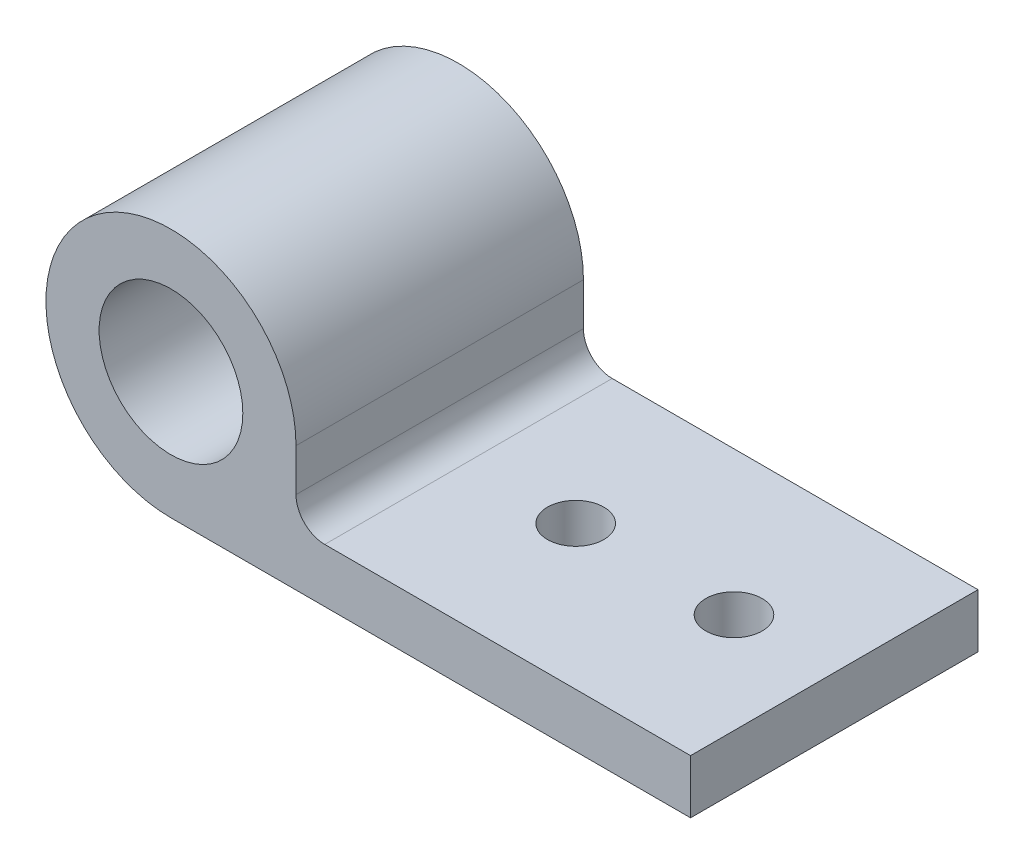
ISO-10303-21;
HEADER;
FILE_DESCRIPTION(('STEP AP214'),'2;1');
FILE_NAME('part.step','',(''),(''),'','','');
FILE_SCHEMA(('AUTOMOTIVE_DESIGN { 1 0 10303 214 1 1 1 1 }'));
ENDSEC;
DATA;
#1=APPLICATION_CONTEXT('core data for automotive mechanical design processes');
#2=APPLICATION_PROTOCOL_DEFINITION('international standard','automotive_design',2000,#1);
#3=PRODUCT_CONTEXT('',#1,'mechanical');
#4=PRODUCT('Part','Part','',(#3));
#5=PRODUCT_RELATED_PRODUCT_CATEGORY('part','',(#4));
#6=PRODUCT_DEFINITION_FORMATION('','',#4);
#7=PRODUCT_DEFINITION_CONTEXT('part definition',#1,'design');
#8=PRODUCT_DEFINITION('design','',#6,#7);
#9=PRODUCT_DEFINITION_SHAPE('','',#8);
#10=(LENGTH_UNIT() NAMED_UNIT(*) SI_UNIT(.MILLI.,.METRE.));
#11=(NAMED_UNIT(*) PLANE_ANGLE_UNIT() SI_UNIT($,.RADIAN.));
#12=(NAMED_UNIT(*) SI_UNIT($,.STERADIAN.) SOLID_ANGLE_UNIT());
#13=UNCERTAINTY_MEASURE_WITH_UNIT(LENGTH_MEASURE(1.E-05),#10,'distance_accuracy_value','');
#14=(GEOMETRIC_REPRESENTATION_CONTEXT(3) GLOBAL_UNCERTAINTY_ASSIGNED_CONTEXT((#13)) GLOBAL_UNIT_ASSIGNED_CONTEXT((#10,
#11,#12)) REPRESENTATION_CONTEXT('',''));
#15=CARTESIAN_POINT('',(0.,0.,0.));
#16=DIRECTION('',(0.,0.,1.));
#17=DIRECTION('',(1.,0.,0.));
#18=AXIS2_PLACEMENT_3D('',#15,#16,#17);
#19=CARTESIAN_POINT('',(13.589,-3.7465,25.4));
#20=DIRECTION('',(0.,0.,-1.));
#21=DIRECTION('',(-1.,0.,0.));
#22=AXIS2_PLACEMENT_3D('',#19,#20,#21);
#23=CYLINDRICAL_SURFACE('',#22,2.54);
#24=DIRECTION('',(0.,0.,1.));
#25=VECTOR('',#24,1.);
#26=CARTESIAN_POINT('',(13.589,-6.2865,25.4));
#27=LINE('',#26,#25);
#28=CARTESIAN_POINT('',(13.589,-6.2865,0.));
#29=VERTEX_POINT('',#28);
#30=CARTESIAN_POINT('',(13.589,-6.2865,25.4));
#31=VERTEX_POINT('',#30);
#32=EDGE_CURVE('E143',#29,#31,#27,.T.);
#33=ORIENTED_EDGE('',*,*,#32,.F.);
#34=CARTESIAN_POINT('',(13.589,-3.7465,0.));
#35=DIRECTION('',(0.,0.,1.));
#36=DIRECTION('',(1.,0.,0.));
#37=AXIS2_PLACEMENT_3D('',#34,#35,#36);
#38=CIRCLE('',#37,2.54);
#39=CARTESIAN_POINT('',(11.049,-3.7465,0.));
#40=VERTEX_POINT('',#39);
#41=EDGE_CURVE('E90',#29,#40,#38,.F.);
#42=ORIENTED_EDGE('',*,*,#41,.T.);
#43=DIRECTION('',(0.,0.,1.));
#44=VECTOR('',#43,1.);
#45=CARTESIAN_POINT('',(11.049,-3.7465,25.4));
#46=LINE('',#45,#44);
#47=CARTESIAN_POINT('',(11.049,-3.7465,25.4));
#48=VERTEX_POINT('',#47);
#49=EDGE_CURVE('E209',#48,#40,#46,.F.);
#50=ORIENTED_EDGE('',*,*,#49,.F.);
#51=CARTESIAN_POINT('',(13.589,-3.7465,25.4));
#52=DIRECTION('',(0.,0.,1.));
#53=DIRECTION('',(1.,0.,0.));
#54=AXIS2_PLACEMENT_3D('',#51,#52,#53);
#55=CIRCLE('',#54,2.54);
#56=EDGE_CURVE('E12',#48,#31,#55,.T.);
#57=ORIENTED_EDGE('',*,*,#56,.T.);
#58=EDGE_LOOP('',(#33,#42,#50,#57));
#59=FACE_BOUND('',#58,.T.);
#60=ADVANCED_FACE('F82',(#59),#23,.F.);
#61=CARTESIAN_POINT('',(0.,-11.049,25.4));
#62=DIRECTION('',(0.,1.,0.));
#63=DIRECTION('',(0.,0.,1.));
#64=AXIS2_PLACEMENT_3D('',#61,#62,#63);
#65=PLANE('',#64);
#66=CARTESIAN_POINT('',(37.0528588893814,-11.049,12.7));
#67=DIRECTION('',(0.,1.,0.));
#68=DIRECTION('',(-1.,0.,0.));
#69=AXIS2_PLACEMENT_3D('',#66,#67,#68);
#70=CIRCLE('',#69,2.4892);
#71=CARTESIAN_POINT('',(34.5636588893814,-11.049,12.7));
#72=VERTEX_POINT('',#71);
#73=EDGE_CURVE('E202',#72,#72,#70,.T.);
#74=ORIENTED_EDGE('',*,*,#73,.T.);
#75=EDGE_LOOP('',(#74));
#76=FACE_BOUND('',#75,.T.);
#77=CARTESIAN_POINT('',(23.0632449919482,-11.049,12.7));
#78=DIRECTION('',(0.,1.,0.));
#79=DIRECTION('',(-1.,0.,0.));
#80=AXIS2_PLACEMENT_3D('',#77,#78,#79);
#81=CIRCLE('',#80,2.4892);
#82=CARTESIAN_POINT('',(20.5740449919482,-11.049,12.7));
#83=VERTEX_POINT('',#82);
#84=EDGE_CURVE('E272',#83,#83,#81,.T.);
#85=ORIENTED_EDGE('',*,*,#84,.T.);
#86=EDGE_LOOP('',(#85));
#87=FACE_BOUND('',#86,.T.);
#88=DIRECTION('',(1.,0.,0.));
#89=VECTOR('',#88,1.);
#90=CARTESIAN_POINT('',(0.,-11.049,0.));
#91=LINE('',#90,#89);
#92=CARTESIAN_POINT('',(0.,-11.049,0.));
#93=VERTEX_POINT('',#92);
#94=CARTESIAN_POINT('',(45.91627088,-11.049,0.));
#95=VERTEX_POINT('',#94);
#96=EDGE_CURVE('E154',#93,#95,#91,.T.);
#97=ORIENTED_EDGE('',*,*,#96,.T.);
#98=DIRECTION('',(0.,0.,-1.));
#99=VECTOR('',#98,1.);
#100=CARTESIAN_POINT('',(45.91627088,-11.049,25.4));
#101=LINE('',#100,#99);
#102=CARTESIAN_POINT('',(45.91627088,-11.049,25.4));
#103=VERTEX_POINT('',#102);
#104=EDGE_CURVE('E144',#103,#95,#101,.T.);
#105=ORIENTED_EDGE('',*,*,#104,.F.);
#106=DIRECTION('',(1.,0.,0.));
#107=VECTOR('',#106,1.);
#108=CARTESIAN_POINT('',(0.,-11.049,25.4));
#109=LINE('',#108,#107);
#110=CARTESIAN_POINT('',(0.,-11.049,25.4));
#111=VERTEX_POINT('',#110);
#112=EDGE_CURVE('E149',#111,#103,#109,.T.);
#113=ORIENTED_EDGE('',*,*,#112,.F.);
#114=DIRECTION('',(0.,0.,-1.));
#115=VECTOR('',#114,1.);
#116=CARTESIAN_POINT('',(0.,-11.049,25.4));
#117=LINE('',#116,#115);
#118=EDGE_CURVE('E133',#111,#93,#117,.T.);
#119=ORIENTED_EDGE('',*,*,#118,.T.);
#120=EDGE_LOOP('',(#97,#105,#113,#119));
#121=FACE_BOUND('',#120,.T.);
#122=ADVANCED_FACE('F156',(#76,#87,#121),#65,.F.);
#123=CARTESIAN_POINT('',(45.91627088,0.,25.4));
#124=DIRECTION('',(-1.,0.,0.));
#125=DIRECTION('',(0.,0.,1.));
#126=AXIS2_PLACEMENT_3D('',#123,#124,#125);
#127=PLANE('',#126);
#128=DIRECTION('',(0.,1.,0.));
#129=VECTOR('',#128,1.);
#130=CARTESIAN_POINT('',(45.91627088,0.,0.));
#131=LINE('',#130,#129);
#132=CARTESIAN_POINT('',(45.91627088,-6.2865,0.));
#133=VERTEX_POINT('',#132);
#134=EDGE_CURVE('E181',#95,#133,#131,.T.);
#135=ORIENTED_EDGE('',*,*,#134,.T.);
#136=DIRECTION('',(0.,0.,-1.));
#137=VECTOR('',#136,1.);
#138=CARTESIAN_POINT('',(45.91627088,-6.2865,25.4));
#139=LINE('',#138,#137);
#140=CARTESIAN_POINT('',(45.91627088,-6.2865,25.4));
#141=VERTEX_POINT('',#140);
#142=EDGE_CURVE('E189',#141,#133,#139,.T.);
#143=ORIENTED_EDGE('',*,*,#142,.F.);
#144=DIRECTION('',(0.,1.,0.));
#145=VECTOR('',#144,1.);
#146=CARTESIAN_POINT('',(45.91627088,0.,25.4));
#147=LINE('',#146,#145);
#148=EDGE_CURVE('E160',#103,#141,#147,.T.);
#149=ORIENTED_EDGE('',*,*,#148,.F.);
#150=ORIENTED_EDGE('',*,*,#104,.T.);
#151=EDGE_LOOP('',(#135,#143,#149,#150));
#152=FACE_BOUND('',#151,.T.);
#153=ADVANCED_FACE('F220',(#152),#127,.F.);
#154=CARTESIAN_POINT('',(0.,-6.28650000000001,25.4));
#155=DIRECTION('',(0.,1.,0.));
#156=DIRECTION('',(-1.,0.,0.));
#157=AXIS2_PLACEMENT_3D('',#154,#155,#156);
#158=PLANE('',#157);
#159=CARTESIAN_POINT('',(37.0528588893814,-6.2865,12.7));
#160=DIRECTION('',(0.,1.,0.));
#161=DIRECTION('',(-1.,0.,0.));
#162=AXIS2_PLACEMENT_3D('',#159,#160,#161);
#163=CIRCLE('',#162,2.4892);
#164=CARTESIAN_POINT('',(34.5636588893814,-6.2865,12.7));
#165=VERTEX_POINT('',#164);
#166=EDGE_CURVE('E267',#165,#165,#163,.T.);
#167=ORIENTED_EDGE('',*,*,#166,.F.);
#168=EDGE_LOOP('',(#167));
#169=FACE_BOUND('',#168,.T.);
#170=CARTESIAN_POINT('',(23.0632449919482,-6.2865,12.7));
#171=DIRECTION('',(0.,1.,0.));
#172=DIRECTION('',(-1.,0.,0.));
#173=AXIS2_PLACEMENT_3D('',#170,#171,#172);
#174=CIRCLE('',#173,2.4892);
#175=CARTESIAN_POINT('',(20.5740449919482,-6.2865,12.7));
#176=VERTEX_POINT('',#175);
#177=EDGE_CURVE('E171',#176,#176,#174,.T.);
#178=ORIENTED_EDGE('',*,*,#177,.F.);
#179=EDGE_LOOP('',(#178));
#180=FACE_BOUND('',#179,.T.);
#181=DIRECTION('',(1.,0.,0.));
#182=VECTOR('',#181,1.);
#183=CARTESIAN_POINT('',(0.,-6.28650000000001,0.));
#184=LINE('',#183,#182);
#185=EDGE_CURVE('E168',#29,#133,#184,.T.);
#186=ORIENTED_EDGE('',*,*,#185,.F.);
#187=ORIENTED_EDGE('',*,*,#32,.T.);
#188=DIRECTION('',(1.,0.,0.));
#189=VECTOR('',#188,1.);
#190=CARTESIAN_POINT('',(0.,-6.28650000000001,25.4));
#191=LINE('',#190,#189);
#192=EDGE_CURVE('E165',#31,#141,#191,.T.);
#193=ORIENTED_EDGE('',*,*,#192,.T.);
#194=ORIENTED_EDGE('',*,*,#142,.T.);
#195=EDGE_LOOP('',(#186,#187,#193,#194));
#196=FACE_BOUND('',#195,.T.);
#197=ADVANCED_FACE('F224',(#169,#180,#196),#158,.T.);
#198=CARTESIAN_POINT('',(11.049,0.,25.4));
#199=DIRECTION('',(1.,0.,0.));
#200=DIRECTION('',(0.,1.,0.));
#201=AXIS2_PLACEMENT_3D('',#198,#199,#200);
#202=PLANE('',#201);
#203=DIRECTION('',(0.,-1.,0.));
#204=VECTOR('',#203,1.);
#205=CARTESIAN_POINT('',(11.049,0.,25.4));
#206=LINE('',#205,#204);
#207=CARTESIAN_POINT('',(11.049,0.,25.4));
#208=VERTEX_POINT('',#207);
#209=EDGE_CURVE('E152',#208,#48,#206,.T.);
#210=ORIENTED_EDGE('',*,*,#209,.T.);
#211=ORIENTED_EDGE('',*,*,#49,.T.);
#212=DIRECTION('',(0.,-1.,0.));
#213=VECTOR('',#212,1.);
#214=CARTESIAN_POINT('',(11.049,0.,0.));
#215=LINE('',#214,#213);
#216=CARTESIAN_POINT('',(11.049,0.,0.));
#217=VERTEX_POINT('',#216);
#218=EDGE_CURVE('E161',#217,#40,#215,.T.);
#219=ORIENTED_EDGE('',*,*,#218,.F.);
#220=DIRECTION('',(0.,0.,-1.));
#221=VECTOR('',#220,1.);
#222=CARTESIAN_POINT('',(11.049,0.,25.4));
#223=LINE('',#222,#221);
#224=EDGE_CURVE('E178',#208,#217,#223,.T.);
#225=ORIENTED_EDGE('',*,*,#224,.F.);
#226=EDGE_LOOP('',(#210,#211,#219,#225));
#227=FACE_BOUND('',#226,.T.);
#228=ADVANCED_FACE('F214',(#227),#202,.T.);
#229=CARTESIAN_POINT('',(0.,0.,0.));
#230=DIRECTION('',(0.,0.,1.));
#231=DIRECTION('',(1.,0.,0.));
#232=AXIS2_PLACEMENT_3D('',#229,#230,#231);
#233=PLANE('',#232);
#234=ORIENTED_EDGE('',*,*,#41,.F.);
#235=ORIENTED_EDGE('',*,*,#185,.T.);
#236=ORIENTED_EDGE('',*,*,#134,.F.);
#237=ORIENTED_EDGE('',*,*,#96,.F.);
#238=CARTESIAN_POINT('',(0.,0.,0.));
#239=DIRECTION('',(0.,0.,1.));
#240=DIRECTION('',(1.,0.,0.));
#241=AXIS2_PLACEMENT_3D('',#238,#239,#240);
#242=CIRCLE('',#241,11.049);
#243=EDGE_CURVE('E138',#217,#93,#242,.T.);
#244=ORIENTED_EDGE('',*,*,#243,.F.);
#245=ORIENTED_EDGE('',*,*,#218,.T.);
#246=EDGE_LOOP('',(#234,#235,#236,#237,#244,#245));
#247=FACE_BOUND('',#246,.T.);
#248=CARTESIAN_POINT('',(0.,0.127,0.));
#249=DIRECTION('',(0.,0.,1.));
#250=DIRECTION('',(1.,0.,0.));
#251=AXIS2_PLACEMENT_3D('',#248,#249,#250);
#252=CIRCLE('',#251,6.35);
#253=CARTESIAN_POINT('',(6.35,0.127,0.));
#254=VERTEX_POINT('',#253);
#255=EDGE_CURVE('E199',#254,#254,#252,.T.);
#256=ORIENTED_EDGE('',*,*,#255,.T.);
#257=EDGE_LOOP('',(#256));
#258=FACE_BOUND('',#257,.T.);
#259=ADVANCED_FACE('F216',(#247,#258),#233,.F.);
#260=CARTESIAN_POINT('',(0.,0.,25.4));
#261=DIRECTION('',(0.,0.,1.));
#262=DIRECTION('',(1.,0.,0.));
#263=AXIS2_PLACEMENT_3D('',#260,#261,#262);
#264=PLANE('',#263);
#265=ORIENTED_EDGE('',*,*,#209,.F.);
#266=CARTESIAN_POINT('',(0.,0.,25.4));
#267=DIRECTION('',(0.,0.,1.));
#268=DIRECTION('',(1.,0.,0.));
#269=AXIS2_PLACEMENT_3D('',#266,#267,#268);
#270=CIRCLE('',#269,11.049);
#271=EDGE_CURVE('E136',#208,#111,#270,.T.);
#272=ORIENTED_EDGE('',*,*,#271,.T.);
#273=ORIENTED_EDGE('',*,*,#112,.T.);
#274=ORIENTED_EDGE('',*,*,#148,.T.);
#275=ORIENTED_EDGE('',*,*,#192,.F.);
#276=ORIENTED_EDGE('',*,*,#56,.F.);
#277=EDGE_LOOP('',(#265,#272,#273,#274,#275,#276));
#278=FACE_BOUND('',#277,.T.);
#279=CARTESIAN_POINT('',(0.,0.127,25.4));
#280=DIRECTION('',(0.,0.,1.));
#281=DIRECTION('',(1.,0.,0.));
#282=AXIS2_PLACEMENT_3D('',#279,#280,#281);
#283=CIRCLE('',#282,6.35);
#284=CARTESIAN_POINT('',(6.35,0.127,25.4));
#285=VERTEX_POINT('',#284);
#286=EDGE_CURVE('E195',#285,#285,#283,.T.);
#287=ORIENTED_EDGE('',*,*,#286,.F.);
#288=EDGE_LOOP('',(#287));
#289=FACE_BOUND('',#288,.T.);
#290=ADVANCED_FACE('F146',(#278,#289),#264,.T.);
#291=CARTESIAN_POINT('',(0.,0.127,25.4));
#292=DIRECTION('',(0.,0.,-1.));
#293=DIRECTION('',(-1.,0.,0.));
#294=AXIS2_PLACEMENT_3D('',#291,#292,#293);
#295=CYLINDRICAL_SURFACE('',#294,6.35);
#296=ORIENTED_EDGE('',*,*,#286,.T.);
#297=EDGE_LOOP('',(#296));
#298=FACE_BOUND('',#297,.T.);
#299=ORIENTED_EDGE('',*,*,#255,.F.);
#300=EDGE_LOOP('',(#299));
#301=FACE_BOUND('',#300,.T.);
#302=ADVANCED_FACE('F241',(#298,#301),#295,.F.);
#303=CARTESIAN_POINT('',(0.,0.,25.4));
#304=DIRECTION('',(0.,0.,-1.));
#305=DIRECTION('',(-1.,0.,0.));
#306=AXIS2_PLACEMENT_3D('',#303,#304,#305);
#307=CYLINDRICAL_SURFACE('',#306,11.049);
#308=ORIENTED_EDGE('',*,*,#243,.T.);
#309=ORIENTED_EDGE('',*,*,#118,.F.);
#310=ORIENTED_EDGE('',*,*,#271,.F.);
#311=ORIENTED_EDGE('',*,*,#224,.T.);
#312=EDGE_LOOP('',(#308,#309,#310,#311));
#313=FACE_BOUND('',#312,.T.);
#314=ADVANCED_FACE('F135',(#313),#307,.T.);
#315=CARTESIAN_POINT('',(23.0632449919482,-11.049,12.7));
#316=DIRECTION('',(0.,1.,0.));
#317=DIRECTION('',(-1.,0.,0.));
#318=AXIS2_PLACEMENT_3D('',#315,#316,#317);
#319=CYLINDRICAL_SURFACE('',#318,2.4892);
#320=ORIENTED_EDGE('',*,*,#84,.F.);
#321=EDGE_LOOP('',(#320));
#322=FACE_BOUND('',#321,.T.);
#323=ORIENTED_EDGE('',*,*,#177,.T.);
#324=EDGE_LOOP('',(#323));
#325=FACE_BOUND('',#324,.T.);
#326=ADVANCED_FACE('F244',(#322,#325),#319,.F.);
#327=CARTESIAN_POINT('',(37.0528588893814,-11.049,12.7));
#328=DIRECTION('',(0.,1.,0.));
#329=DIRECTION('',(-1.,0.,0.));
#330=AXIS2_PLACEMENT_3D('',#327,#328,#329);
#331=CYLINDRICAL_SURFACE('',#330,2.4892);
#332=ORIENTED_EDGE('',*,*,#73,.F.);
#333=EDGE_LOOP('',(#332));
#334=FACE_BOUND('',#333,.T.);
#335=ORIENTED_EDGE('',*,*,#166,.T.);
#336=EDGE_LOOP('',(#335));
#337=FACE_BOUND('',#336,.T.);
#338=ADVANCED_FACE('F249',(#334,#337),#331,.F.);
#339=CLOSED_SHELL('',(#60,#122,#153,#197,#228,#259,#290,#302,#314,#326,#338));
#340=MANIFOLD_SOLID_BREP('B2',#339);
#341=ADVANCED_BREP_SHAPE_REPRESENTATION('',(#18,#340),#14);
#342=SHAPE_DEFINITION_REPRESENTATION(#9,#341);
ENDSEC;
END-ISO-10303-21;
